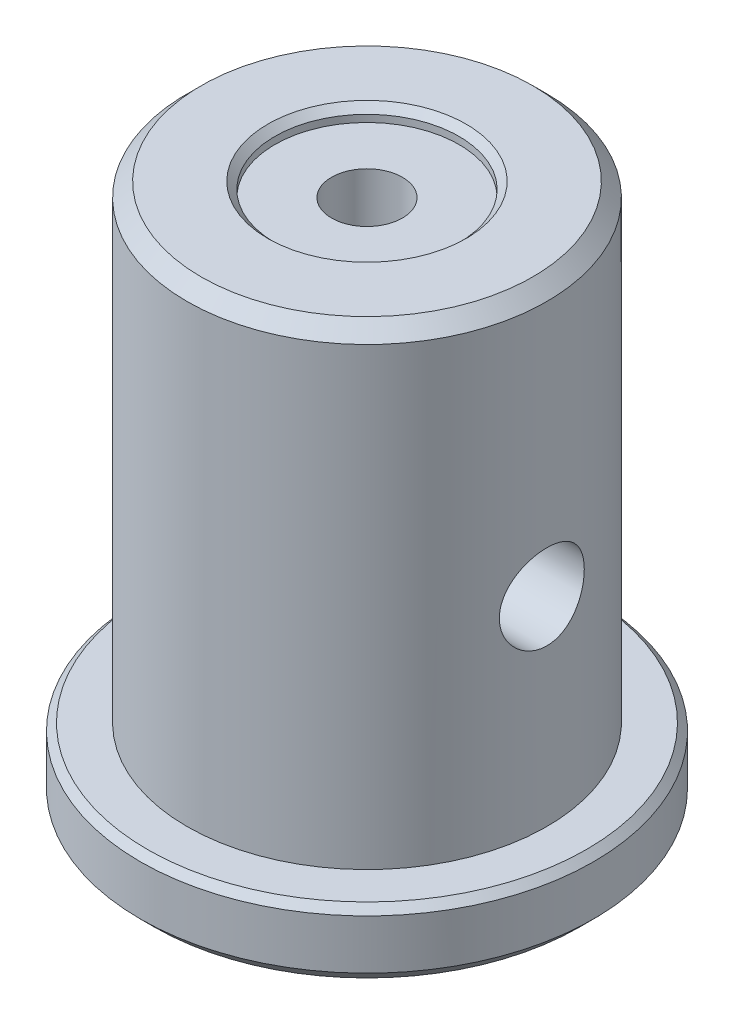
ISO-10303-21;
HEADER;
FILE_DESCRIPTION(('STEP AP214'),'2;1');
FILE_NAME('part.step','',(''),(''),'','','');
FILE_SCHEMA(('AUTOMOTIVE_DESIGN { 1 0 10303 214 1 1 1 1 }'));
ENDSEC;
DATA;
#1=APPLICATION_CONTEXT('core data for automotive mechanical design processes');
#2=APPLICATION_PROTOCOL_DEFINITION('international standard','automotive_design',2000,#1);
#3=PRODUCT_CONTEXT('',#1,'mechanical');
#4=PRODUCT('Part','Part','',(#3));
#5=PRODUCT_RELATED_PRODUCT_CATEGORY('part','',(#4));
#6=PRODUCT_DEFINITION_FORMATION('','',#4);
#7=PRODUCT_DEFINITION_CONTEXT('part definition',#1,'design');
#8=PRODUCT_DEFINITION('design','',#6,#7);
#9=PRODUCT_DEFINITION_SHAPE('','',#8);
#10=(LENGTH_UNIT() NAMED_UNIT(*) SI_UNIT(.MILLI.,.METRE.));
#11=(NAMED_UNIT(*) PLANE_ANGLE_UNIT() SI_UNIT($,.RADIAN.));
#12=(NAMED_UNIT(*) SI_UNIT($,.STERADIAN.) SOLID_ANGLE_UNIT());
#13=UNCERTAINTY_MEASURE_WITH_UNIT(LENGTH_MEASURE(1.E-05),#10,'distance_accuracy_value','');
#14=(GEOMETRIC_REPRESENTATION_CONTEXT(3) GLOBAL_UNCERTAINTY_ASSIGNED_CONTEXT((#13)) GLOBAL_UNIT_ASSIGNED_CONTEXT((#10,
#11,#12)) REPRESENTATION_CONTEXT('',''));
#15=CARTESIAN_POINT('',(0.,0.,0.));
#16=DIRECTION('',(0.,0.,1.));
#17=DIRECTION('',(1.,0.,0.));
#18=AXIS2_PLACEMENT_3D('',#15,#16,#17);
#19=CARTESIAN_POINT('',(0.,-7.09999999986621,0.));
#20=DIRECTION('',(0.,-1.,0.));
#21=DIRECTION('',(1.,0.,0.));
#22=AXIS2_PLACEMENT_3D('',#19,#20,#21);
#23=CONICAL_SURFACE('',#22,2.49999999977035,1.0297442586083);
#24=CARTESIAN_POINT('',(0.,-5.59784845239619,1.13686837721616E-10));
#25=VERTEX_POINT('',#24);
#26=VERTEX_LOOP('',#25);
#27=FACE_BOUND('',#26,.T.);
#28=CARTESIAN_POINT('',(0.,-7.1,0.));
#29=DIRECTION('',(0.,-1.,0.));
#30=DIRECTION('',(0.,0.,-1.));
#31=AXIS2_PLACEMENT_3D('',#28,#29,#30);
#32=CIRCLE('',#31,2.5);
#33=CARTESIAN_POINT('',(0.,-7.1,-2.5));
#34=VERTEX_POINT('',#33);
#35=EDGE_CURVE('E61',#34,#34,#32,.T.);
#36=ORIENTED_EDGE('',*,*,#35,.T.);
#37=EDGE_LOOP('',(#36));
#38=FACE_BOUND('',#37,.T.);
#39=ADVANCED_FACE('F36',(#27,#38),#23,.F.);
#40=CARTESIAN_POINT('',(0.,-18.1,0.));
#41=DIRECTION('',(0.,-1.,0.));
#42=DIRECTION('',(0.,0.,-1.));
#43=AXIS2_PLACEMENT_3D('',#40,#41,#42);
#44=CYLINDRICAL_SURFACE('',#43,2.5);
#45=CARTESIAN_POINT('',(0.,-18.1,0.));
#46=DIRECTION('',(0.,-1.,0.));
#47=DIRECTION('',(0.,0.,-1.));
#48=AXIS2_PLACEMENT_3D('',#45,#46,#47);
#49=CIRCLE('',#48,2.5);
#50=CARTESIAN_POINT('',(0.,-18.1,-2.5));
#51=VERTEX_POINT('',#50);
#52=EDGE_CURVE('E63',#51,#51,#49,.T.);
#53=ORIENTED_EDGE('',*,*,#52,.T.);
#54=EDGE_LOOP('',(#53));
#55=FACE_BOUND('',#54,.T.);
#56=ORIENTED_EDGE('',*,*,#35,.F.);
#57=EDGE_LOOP('',(#56));
#58=FACE_BOUND('',#57,.T.);
#59=ADVANCED_FACE('F57',(#55,#58),#44,.F.);
#60=CARTESIAN_POINT('',(0.,-18.1,0.));
#61=DIRECTION('',(0.,1.,0.));
#62=DIRECTION('',(0.,0.,1.));
#63=AXIS2_PLACEMENT_3D('',#60,#61,#62);
#64=PLANE('',#63);
#65=CARTESIAN_POINT('',(0.,-18.1,0.));
#66=DIRECTION('',(0.,-1.,0.));
#67=DIRECTION('',(0.,0.,-1.));
#68=AXIS2_PLACEMENT_3D('',#65,#66,#67);
#69=CIRCLE('',#68,9.00000000000001);
#70=CARTESIAN_POINT('',(0.,-18.1,-9.00000000000001));
#71=VERTEX_POINT('',#70);
#72=EDGE_CURVE('E66',#71,#71,#69,.T.);
#73=ORIENTED_EDGE('',*,*,#72,.T.);
#74=EDGE_LOOP('',(#73));
#75=FACE_BOUND('',#74,.T.);
#76=ORIENTED_EDGE('',*,*,#52,.F.);
#77=EDGE_LOOP('',(#76));
#78=FACE_BOUND('',#77,.T.);
#79=ADVANCED_FACE('F174',(#75,#78),#64,.F.);
#80=CARTESIAN_POINT('',(0.,6.99999999989132,0.));
#81=DIRECTION('',(0.,1.,0.));
#82=DIRECTION('',(0.,0.,1.));
#83=AXIS2_PLACEMENT_3D('',#80,#81,#82);
#84=CONICAL_SURFACE('',#83,2.49999999977035,1.0297442586083);
#85=CARTESIAN_POINT('',(0.,5.49784845242129,-1.13686837721616E-10));
#86=VERTEX_POINT('',#85);
#87=VERTEX_LOOP('',#86);
#88=FACE_BOUND('',#87,.T.);
#89=CARTESIAN_POINT('',(0.,7.,0.));
#90=DIRECTION('',(0.,1.,0.));
#91=DIRECTION('',(0.,0.,1.));
#92=AXIS2_PLACEMENT_3D('',#89,#90,#91);
#93=CIRCLE('',#92,2.5);
#94=CARTESIAN_POINT('',(0.,7.,2.5));
#95=VERTEX_POINT('',#94);
#96=EDGE_CURVE('E102',#95,#95,#93,.T.);
#97=ORIENTED_EDGE('',*,*,#96,.T.);
#98=EDGE_LOOP('',(#97));
#99=FACE_BOUND('',#98,.T.);
#100=ADVANCED_FACE('F151',(#88,#99),#84,.F.);
#101=CARTESIAN_POINT('',(0.,-18.6,0.));
#102=DIRECTION('',(0.,-1.,0.));
#103=DIRECTION('',(0.,0.,-1.));
#104=AXIS2_PLACEMENT_3D('',#101,#102,#103);
#105=CONICAL_SURFACE('',#104,9.50000000000001,0.785398163397448);
#106=ORIENTED_EDGE('',*,*,#72,.F.);
#107=EDGE_LOOP('',(#106));
#108=FACE_BOUND('',#107,.T.);
#109=CARTESIAN_POINT('',(0.,-18.6,0.));
#110=DIRECTION('',(0.,1.,0.));
#111=DIRECTION('',(0.,0.,1.));
#112=AXIS2_PLACEMENT_3D('',#109,#110,#111);
#113=CIRCLE('',#112,9.50000000000001);
#114=CARTESIAN_POINT('',(0.,-18.6,9.50000000000001));
#115=VERTEX_POINT('',#114);
#116=EDGE_CURVE('E100',#115,#115,#113,.F.);
#117=ORIENTED_EDGE('',*,*,#116,.T.);
#118=EDGE_LOOP('',(#117));
#119=FACE_BOUND('',#118,.T.);
#120=ADVANCED_FACE('F156',(#108,#119),#105,.F.);
#121=CARTESIAN_POINT('',(0.,18.,0.));
#122=DIRECTION('',(0.,1.,0.));
#123=DIRECTION('',(0.,0.,1.));
#124=AXIS2_PLACEMENT_3D('',#121,#122,#123);
#125=CYLINDRICAL_SURFACE('',#124,2.5);
#126=CARTESIAN_POINT('',(0.,18.,0.));
#127=DIRECTION('',(0.,1.,0.));
#128=DIRECTION('',(0.,0.,1.));
#129=AXIS2_PLACEMENT_3D('',#126,#127,#128);
#130=CIRCLE('',#129,2.5);
#131=CARTESIAN_POINT('',(0.,18.,2.5));
#132=VERTEX_POINT('',#131);
#133=EDGE_CURVE('E97',#132,#132,#130,.T.);
#134=ORIENTED_EDGE('',*,*,#133,.T.);
#135=EDGE_LOOP('',(#134));
#136=FACE_BOUND('',#135,.T.);
#137=ORIENTED_EDGE('',*,*,#96,.F.);
#138=EDGE_LOOP('',(#137));
#139=FACE_BOUND('',#138,.T.);
#140=ADVANCED_FACE('F153',(#136,#139),#125,.F.);
#141=CARTESIAN_POINT('',(0.,26.5038387670979,0.));
#142=DIRECTION('',(0.,1.,0.));
#143=DIRECTION('',(0.,0.,1.));
#144=AXIS2_PLACEMENT_3D('',#141,#142,#143);
#145=CYLINDRICAL_SURFACE('',#144,9.50000000000001);
#146=ORIENTED_EDGE('',*,*,#116,.F.);
#147=EDGE_LOOP('',(#146));
#148=FACE_BOUND('',#147,.T.);
#149=CARTESIAN_POINT('',(0.,-19.1,0.));
#150=DIRECTION('',(0.,1.,0.));
#151=DIRECTION('',(0.,0.,1.));
#152=AXIS2_PLACEMENT_3D('',#149,#150,#151);
#153=CIRCLE('',#152,9.50000000000001);
#154=CARTESIAN_POINT('',(0.,-19.1,9.50000000000001));
#155=VERTEX_POINT('',#154);
#156=EDGE_CURVE('E94',#155,#155,#153,.F.);
#157=ORIENTED_EDGE('',*,*,#156,.T.);
#158=EDGE_LOOP('',(#157));
#159=FACE_BOUND('',#158,.T.);
#160=ADVANCED_FACE('F155',(#148,#159),#145,.F.);
#161=CARTESIAN_POINT('',(6.5,18.,0.));
#162=DIRECTION('',(0.,-1.,0.));
#163=DIRECTION('',(0.,0.,-1.));
#164=AXIS2_PLACEMENT_3D('',#161,#162,#163);
#165=PLANE('',#164);
#166=CARTESIAN_POINT('',(0.,18.,0.));
#167=DIRECTION('',(0.,1.,0.));
#168=DIRECTION('',(0.,0.,1.));
#169=AXIS2_PLACEMENT_3D('',#166,#167,#168);
#170=CIRCLE('',#169,6.5);
#171=CARTESIAN_POINT('',(0.,18.,6.5));
#172=VERTEX_POINT('',#171);
#173=EDGE_CURVE('E91',#172,#172,#170,.T.);
#174=ORIENTED_EDGE('',*,*,#173,.T.);
#175=EDGE_LOOP('',(#174));
#176=FACE_BOUND('',#175,.T.);
#177=ORIENTED_EDGE('',*,*,#133,.F.);
#178=EDGE_LOOP('',(#177));
#179=FACE_BOUND('',#178,.T.);
#180=ADVANCED_FACE('F164',(#176,#179),#165,.F.);
#181=CARTESIAN_POINT('',(9.50000000000001,-19.1,0.));
#182=DIRECTION('',(0.,1.,0.));
#183=DIRECTION('',(0.,0.,1.));
#184=AXIS2_PLACEMENT_3D('',#181,#182,#183);
#185=PLANE('',#184);
#186=ORIENTED_EDGE('',*,*,#156,.F.);
#187=EDGE_LOOP('',(#186));
#188=FACE_BOUND('',#187,.T.);
#189=CARTESIAN_POINT('',(0.,-19.1,0.));
#190=DIRECTION('',(0.,1.,0.));
#191=DIRECTION('',(-1.,0.,0.));
#192=AXIS2_PLACEMENT_3D('',#189,#190,#191);
#193=CIRCLE('',#192,15.);
#194=CARTESIAN_POINT('',(-15.,-19.1,0.));
#195=VERTEX_POINT('',#194);
#196=EDGE_CURVE('E87',#195,#195,#193,.T.);
#197=ORIENTED_EDGE('',*,*,#196,.F.);
#198=EDGE_LOOP('',(#197));
#199=FACE_BOUND('',#198,.T.);
#200=ADVANCED_FACE('F241',(#188,#199),#185,.F.);
#201=CARTESIAN_POINT('',(0.,26.5038387670979,0.));
#202=DIRECTION('',(0.,1.,0.));
#203=DIRECTION('',(0.,0.,1.));
#204=AXIS2_PLACEMENT_3D('',#201,#202,#203);
#205=CYLINDRICAL_SURFACE('',#204,6.5);
#206=CARTESIAN_POINT('',(0.,18.5,0.));
#207=DIRECTION('',(0.,1.,0.));
#208=DIRECTION('',(0.,0.,1.));
#209=AXIS2_PLACEMENT_3D('',#206,#207,#208);
#210=CIRCLE('',#209,6.5);
#211=CARTESIAN_POINT('',(0.,18.5,6.5));
#212=VERTEX_POINT('',#211);
#213=EDGE_CURVE('E90',#212,#212,#210,.T.);
#214=ORIENTED_EDGE('',*,*,#213,.T.);
#215=EDGE_LOOP('',(#214));
#216=FACE_BOUND('',#215,.T.);
#217=ORIENTED_EDGE('',*,*,#173,.F.);
#218=EDGE_LOOP('',(#217));
#219=FACE_BOUND('',#218,.T.);
#220=ADVANCED_FACE('F235',(#216,#219),#205,.F.);
#221=CARTESIAN_POINT('',(0.,-18.1,0.));
#222=DIRECTION('',(0.,1.,0.));
#223=DIRECTION('',(-1.,0.,0.));
#224=AXIS2_PLACEMENT_3D('',#221,#222,#223);
#225=CONICAL_SURFACE('',#224,16.,0.785398163397447);
#226=ORIENTED_EDGE('',*,*,#196,.T.);
#227=EDGE_LOOP('',(#226));
#228=FACE_BOUND('',#227,.T.);
#229=CARTESIAN_POINT('',(0.,-18.1,0.));
#230=DIRECTION('',(0.,1.,0.));
#231=DIRECTION('',(0.,0.,1.));
#232=AXIS2_PLACEMENT_3D('',#229,#230,#231);
#233=CIRCLE('',#232,16.);
#234=CARTESIAN_POINT('',(0.,-18.1,16.));
#235=VERTEX_POINT('',#234);
#236=EDGE_CURVE('E86',#235,#235,#233,.T.);
#237=ORIENTED_EDGE('',*,*,#236,.F.);
#238=EDGE_LOOP('',(#237));
#239=FACE_BOUND('',#238,.T.);
#240=ADVANCED_FACE('F231',(#228,#239),#225,.T.);
#241=CARTESIAN_POINT('',(0.,19.,0.));
#242=DIRECTION('',(0.,1.,0.));
#243=DIRECTION('',(0.,0.,1.));
#244=AXIS2_PLACEMENT_3D('',#241,#242,#243);
#245=CONICAL_SURFACE('',#244,7.,0.785398163397448);
#246=CARTESIAN_POINT('',(0.,19.,0.));
#247=DIRECTION('',(0.,1.,0.));
#248=DIRECTION('',(0.,0.,1.));
#249=AXIS2_PLACEMENT_3D('',#246,#247,#248);
#250=CIRCLE('',#249,7.);
#251=CARTESIAN_POINT('',(0.,19.,7.));
#252=VERTEX_POINT('',#251);
#253=EDGE_CURVE('E83',#252,#252,#250,.T.);
#254=ORIENTED_EDGE('',*,*,#253,.T.);
#255=EDGE_LOOP('',(#254));
#256=FACE_BOUND('',#255,.T.);
#257=ORIENTED_EDGE('',*,*,#213,.F.);
#258=EDGE_LOOP('',(#257));
#259=FACE_BOUND('',#258,.T.);
#260=ADVANCED_FACE('F225',(#256,#259),#245,.F.);
#261=CARTESIAN_POINT('',(0.,26.5038387670979,0.));
#262=DIRECTION('',(0.,1.,0.));
#263=DIRECTION('',(0.,0.,1.));
#264=AXIS2_PLACEMENT_3D('',#261,#262,#263);
#265=CYLINDRICAL_SURFACE('',#264,16.);
#266=ORIENTED_EDGE('',*,*,#236,.T.);
#267=EDGE_LOOP('',(#266));
#268=FACE_BOUND('',#267,.T.);
#269=CARTESIAN_POINT('',(0.,-14.6,0.));
#270=DIRECTION('',(0.,-1.,0.));
#271=DIRECTION('',(0.,0.,-1.));
#272=AXIS2_PLACEMENT_3D('',#269,#270,#271);
#273=CIRCLE('',#272,16.);
#274=CARTESIAN_POINT('',(0.,-14.6,-16.));
#275=VERTEX_POINT('',#274);
#276=EDGE_CURVE('E82',#275,#275,#273,.F.);
#277=ORIENTED_EDGE('',*,*,#276,.F.);
#278=EDGE_LOOP('',(#277));
#279=FACE_BOUND('',#278,.T.);
#280=ADVANCED_FACE('F221',(#268,#279),#265,.T.);
#281=CARTESIAN_POINT('',(11.7,19.,0.));
#282=DIRECTION('',(0.,-1.,0.));
#283=DIRECTION('',(0.,0.,-1.));
#284=AXIS2_PLACEMENT_3D('',#281,#282,#283);
#285=PLANE('',#284);
#286=CARTESIAN_POINT('',(0.,19.,0.));
#287=DIRECTION('',(0.,-1.,0.));
#288=DIRECTION('',(0.,0.,-1.));
#289=AXIS2_PLACEMENT_3D('',#286,#287,#288);
#290=CIRCLE('',#289,11.7);
#291=CARTESIAN_POINT('',(0.,19.,-11.7));
#292=VERTEX_POINT('',#291);
#293=EDGE_CURVE('E79',#292,#292,#290,.T.);
#294=ORIENTED_EDGE('',*,*,#293,.F.);
#295=EDGE_LOOP('',(#294));
#296=FACE_BOUND('',#295,.T.);
#297=ORIENTED_EDGE('',*,*,#253,.F.);
#298=EDGE_LOOP('',(#297));
#299=FACE_BOUND('',#298,.T.);
#300=ADVANCED_FACE('F215',(#296,#299),#285,.F.);
#301=CARTESIAN_POINT('',(0.,-14.6,0.));
#302=DIRECTION('',(0.,-1.,0.));
#303=DIRECTION('',(1.,0.,0.));
#304=AXIS2_PLACEMENT_3D('',#301,#302,#303);
#305=CONICAL_SURFACE('',#304,16.,0.78539816339745);
#306=ORIENTED_EDGE('',*,*,#276,.T.);
#307=EDGE_LOOP('',(#306));
#308=FACE_BOUND('',#307,.T.);
#309=CARTESIAN_POINT('',(0.,-14.1,0.));
#310=DIRECTION('',(0.,-1.,0.));
#311=DIRECTION('',(1.,0.,0.));
#312=AXIS2_PLACEMENT_3D('',#309,#310,#311);
#313=CIRCLE('',#312,15.5);
#314=CARTESIAN_POINT('',(15.5,-14.1,0.));
#315=VERTEX_POINT('',#314);
#316=EDGE_CURVE('E76',#315,#315,#313,.T.);
#317=ORIENTED_EDGE('',*,*,#316,.T.);
#318=EDGE_LOOP('',(#317));
#319=FACE_BOUND('',#318,.T.);
#320=ADVANCED_FACE('F211',(#308,#319),#305,.T.);
#321=CARTESIAN_POINT('',(0.,18.,0.));
#322=DIRECTION('',(0.,-1.,0.));
#323=DIRECTION('',(0.,0.,-1.));
#324=AXIS2_PLACEMENT_3D('',#321,#322,#323);
#325=CONICAL_SURFACE('',#324,12.7,0.78539816339745);
#326=CARTESIAN_POINT('',(0.,18.,0.));
#327=DIRECTION('',(0.,1.,0.));
#328=DIRECTION('',(0.,0.,1.));
#329=AXIS2_PLACEMENT_3D('',#326,#327,#328);
#330=CIRCLE('',#329,12.7);
#331=CARTESIAN_POINT('',(0.,18.,12.7));
#332=VERTEX_POINT('',#331);
#333=EDGE_CURVE('E49',#332,#332,#330,.F.);
#334=ORIENTED_EDGE('',*,*,#333,.F.);
#335=EDGE_LOOP('',(#334));
#336=FACE_BOUND('',#335,.T.);
#337=ORIENTED_EDGE('',*,*,#293,.T.);
#338=EDGE_LOOP('',(#337));
#339=FACE_BOUND('',#338,.T.);
#340=ADVANCED_FACE('F207',(#336,#339),#325,.T.);
#341=CARTESIAN_POINT('',(15.5,-14.1,0.));
#342=DIRECTION('',(0.,-1.,0.));
#343=DIRECTION('',(0.,0.,-1.));
#344=AXIS2_PLACEMENT_3D('',#341,#342,#343);
#345=PLANE('',#344);
#346=ORIENTED_EDGE('',*,*,#316,.F.);
#347=EDGE_LOOP('',(#346));
#348=FACE_BOUND('',#347,.T.);
#349=CARTESIAN_POINT('',(0.,-14.1,0.));
#350=DIRECTION('',(0.,1.,0.));
#351=DIRECTION('',(0.,0.,1.));
#352=AXIS2_PLACEMENT_3D('',#349,#350,#351);
#353=CIRCLE('',#352,12.7);
#354=CARTESIAN_POINT('',(0.,-14.1,12.7));
#355=VERTEX_POINT('',#354);
#356=EDGE_CURVE('E11',#355,#355,#353,.T.);
#357=ORIENTED_EDGE('',*,*,#356,.F.);
#358=EDGE_LOOP('',(#357));
#359=FACE_BOUND('',#358,.T.);
#360=ADVANCED_FACE('F117',(#348,#359),#345,.F.);
#361=CARTESIAN_POINT('',(0.,26.5038387670979,0.));
#362=DIRECTION('',(0.,1.,0.));
#363=DIRECTION('',(0.,0.,1.));
#364=AXIS2_PLACEMENT_3D('',#361,#362,#363);
#365=CYLINDRICAL_SURFACE('',#364,12.7);
#366=CARTESIAN_POINT('',(-12.3405834546021,-0.0499999999999997,-3.));
#367=CARTESIAN_POINT('',(-12.3405867552515,-0.215969025775935,-2.9999947986192));
#368=CARTESIAN_POINT('',(-12.3439681639376,-0.381997776506413,-2.98618025270879));
#369=CARTESIAN_POINT('',(-12.3570983771738,-0.709308606239805,-2.93136245477037));
#370=CARTESIAN_POINT('',(-12.3668512939366,-0.870587549383247,-2.89034164338149));
#371=CARTESIAN_POINT('',(-12.3915597141969,-1.1836170544443,-2.78249577795815));
#372=CARTESIAN_POINT('',(-12.406508961645,-1.33537881625545,-2.71570174263797));
#373=CARTESIAN_POINT('',(-12.439917980932,-1.62555316647854,-2.5582975169812));
#374=CARTESIAN_POINT('',(-12.4583778022552,-1.7639655666796,-2.46768699092613));
#375=CARTESIAN_POINT('',(-12.4971341157553,-2.02623513327086,-2.26332000863187));
#376=CARTESIAN_POINT('',(-12.5174573393053,-2.14979121710142,-2.14918216282701));
#377=CARTESIAN_POINT('',(-12.5574177003081,-2.37619548072849,-1.90182286693526));
#378=CARTESIAN_POINT('',(-12.5770547786081,-2.4790418787585,-1.76859977652744));
#379=CARTESIAN_POINT('',(-12.6137239719163,-2.66232062570419,-1.48480893314834));
#380=CARTESIAN_POINT('',(-12.6307208615052,-2.74245999805565,-1.33404702472816));
#381=CARTESIAN_POINT('',(-12.6598909936041,-2.87614924636056,-1.02072515323631));
#382=CARTESIAN_POINT('',(-12.6720648694535,-2.92970261371955,-0.858166742555064));
#383=CARTESIAN_POINT('',(-12.6900283681532,-3.00774319217718,-0.529001629765293));
#384=CARTESIAN_POINT('',(-12.6959299939122,-3.03274094705508,-0.362522187479542));
#385=CARTESIAN_POINT('',(-12.7010733204737,-3.05456039400339,-0.027635028781716));
#386=CARTESIAN_POINT('',(-12.7003159043761,-3.05138582219305,0.140772428985136));
#387=CARTESIAN_POINT('',(-12.6923108785029,-3.01732388504276,0.471204028849369));
#388=CARTESIAN_POINT('',(-12.685192248261,-2.98698723227256,0.6332885302704));
#389=CARTESIAN_POINT('',(-12.6654133212508,-2.90034399521758,0.949998324283786));
#390=CARTESIAN_POINT('',(-12.652752748352,-2.84403611689424,1.10462324477204));
#391=CARTESIAN_POINT('',(-12.6231105369077,-2.70658447194374,1.40351094180074));
#392=CARTESIAN_POINT('',(-12.6060939900068,-2.62523893662922,1.54767732548809));
#393=CARTESIAN_POINT('',(-12.569594968861,-2.44017288338061,1.82050994076874));
#394=CARTESIAN_POINT('',(-12.5501121075764,-2.3364488517769,1.94917373333533));
#395=CARTESIAN_POINT('',(-12.5102557426675,-2.10659648028451,2.19062975846301));
#396=CARTESIAN_POINT('',(-12.4898720962146,-1.97998644564598,2.30296222384418));
#397=CARTESIAN_POINT('',(-12.4509479008397,-1.70951242089481,2.5048957074095));
#398=CARTESIAN_POINT('',(-12.4324074202314,-1.56564779170528,2.59449588325037));
#399=CARTESIAN_POINT('',(-12.3992364452359,-1.26391941122217,2.74867389435204));
#400=CARTESIAN_POINT('',(-12.3846216061614,-1.10600285675176,2.81315199075165));
#401=CARTESIAN_POINT('',(-12.361163891032,-0.781145656487394,2.91450898004239));
#402=CARTESIAN_POINT('',(-12.3523199281954,-0.614206716220897,2.95139306967752));
#403=CARTESIAN_POINT('',(-12.3416305703028,-0.28027884252791,2.99577506689082));
#404=CARTESIAN_POINT('',(-12.3396244346743,-0.11338467084859,3.0039480461921));
#405=CARTESIAN_POINT('',(-12.3424021208832,0.219381976332526,2.99251467034554));
#406=CARTESIAN_POINT('',(-12.3471853912632,0.385254533714076,2.97291057134052));
#407=CARTESIAN_POINT('',(-12.3628499077692,0.70883464396225,2.90706871465485));
#408=CARTESIAN_POINT('',(-12.37364334047,0.866624835840614,2.86121423179317));
#409=CARTESIAN_POINT('',(-12.4000305578142,1.17228105058354,2.74459361459815));
#410=CARTESIAN_POINT('',(-12.4156248628205,1.32014599554064,2.67382477969692));
#411=CARTESIAN_POINT('',(-12.4502018670965,1.60464260798376,2.5079376913544));
#412=CARTESIAN_POINT('',(-12.4692397057665,1.74102882937843,2.41241023649747));
#413=CARTESIAN_POINT('',(-12.508418891342,1.99608323519417,2.20024312204814));
#414=CARTESIAN_POINT('',(-12.5285603989996,2.1147488291373,2.08360038123467));
#415=CARTESIAN_POINT('',(-12.5682154806913,2.33367575658374,1.8294351289871));
#416=CARTESIAN_POINT('',(-12.5877053868826,2.4334731277362,1.69150862917181));
#417=CARTESIAN_POINT('',(-12.6233979717533,2.60848491861007,1.40045958706062));
#418=CARTESIAN_POINT('',(-12.6396008155023,2.68370057289222,1.24733780841667));
#419=CARTESIAN_POINT('',(-12.6667953232136,2.80679899739152,0.931266340092587));
#420=CARTESIAN_POINT('',(-12.6778226529874,2.85486931464834,0.768392904306747));
#421=CARTESIAN_POINT('',(-12.6935789726756,2.92288709761498,0.4365882415509));
#422=CARTESIAN_POINT('',(-12.6983090399519,2.94283937391006,0.267658055874662));
#423=CARTESIAN_POINT('',(-12.7008993537832,2.95380863416807,-0.0670858950952627));
#424=CARTESIAN_POINT('',(-12.698922999739,2.94551382980964,-0.23287620652618));
#425=CARTESIAN_POINT('',(-12.6886792846242,2.90178385470652,-0.56062883555788));
#426=CARTESIAN_POINT('',(-12.6804120752351,2.86634933833887,-0.722591245357751));
#427=CARTESIAN_POINT('',(-12.6585349476798,2.76969776966396,-1.03745535327696));
#428=CARTESIAN_POINT('',(-12.6449483253229,2.70859305324402,-1.19039325739078));
#429=CARTESIAN_POINT('',(-12.6138718519278,2.56244006301943,-1.48392969727621));
#430=CARTESIAN_POINT('',(-12.5963815576374,2.47738906988803,-1.62452682925617));
#431=CARTESIAN_POINT('',(-12.5589188788384,2.2835926487413,-1.89269784116764));
#432=CARTESIAN_POINT('',(-12.538900801949,2.17437232281497,-2.01992216623951));
#433=CARTESIAN_POINT('',(-12.498861896439,1.9362761933158,-2.2544712498921));
#434=CARTESIAN_POINT('',(-12.4788410683609,1.80739553893703,-2.36179108290443));
#435=CARTESIAN_POINT('',(-12.4406982518011,1.53112796939278,-2.55517580989632));
#436=CARTESIAN_POINT('',(-12.4226122154044,1.38347543293646,-2.64086882423842));
#437=CARTESIAN_POINT('',(-12.3908548561017,1.07545954815947,-2.78608721227337));
#438=CARTESIAN_POINT('',(-12.377180079871,0.915106265625365,-2.84563306834565));
#439=CARTESIAN_POINT('',(-12.3581116997091,0.620683067717766,-2.92718665623946));
#440=CARTESIAN_POINT('',(-12.3515853338036,0.488113622566377,-2.95443550510605));
#441=CARTESIAN_POINT('',(-12.3428200100531,0.220375881220646,-2.99084369124859));
#442=CARTESIAN_POINT('',(-12.3405807657064,0.0852077593016652,-3.00000423733911));
#443=CARTESIAN_POINT('',(-12.3405834546021,-0.0499999999999997,-3.));
#444=B_SPLINE_CURVE_WITH_KNOTS('',3,(#366,#367,#368,#369,#370,#371,#372,#373,#374,#375,#376,
#377,#378,#379,#380,#381,#382,#383,#384,#385,#386,#387,#388,#389,#390,#391,#392,#393,#394,#395,
#396,#397,#398,#399,#400,#401,#402,#403,#404,#405,#406,#407,#408,#409,#410,#411,#412,#413,#414,
#415,#416,#417,#418,#419,#420,#421,#422,#423,#424,#425,#426,#427,#428,#429,#430,#431,#432,#433,
#434,#435,#436,#437,#438,#439,#440,#441,#442,#443),.UNSPECIFIED.,.T.,.F.,(4,2,2,2,2,2,2,2,2,2,2,
2,2,2,2,2,2,2,2,2,2,2,2,2,2,2,2,2,2,2,2,2,2,2,2,2,2,2,4),(0.,0.497411026443943,
0.995143402777372,1.49227860492331,1.98942081508859,2.49536478555058,3.00135226653359,
3.51359835731242,4.02577715959639,4.52864792978655,5.03145201194262,5.52428694235286,
6.01714643133854,6.51408654761748,7.01110474580709,7.52015808792639,8.02923029022512,
8.54030348656796,9.05128040890335,9.5501594423104,10.0489979574951,10.5407323472655,
11.0325200545446,11.5330211371553,12.0335953137055,12.5452167410731,13.0568124694697,
13.5648289273917,14.0727584605778,14.568402228839,15.0640340468005,15.5575191492549,
16.0510603142398,16.555330529637,17.0597253658004,17.5722788464447,18.0844300988553,
18.4896763485681,18.8948955153554),.UNSPECIFIED.);
#445=CARTESIAN_POINT('',(-12.3405834546021,-0.0499999999999997,-3.));
#446=VERTEX_POINT('',#445);
#447=EDGE_CURVE('E39',#446,#446,#444,.T.);
#448=ORIENTED_EDGE('',*,*,#447,.F.);
#449=EDGE_LOOP('',(#448));
#450=FACE_BOUND('',#449,.T.);
#451=CARTESIAN_POINT('',(12.3405834546021,-0.0499999999999997,-3.));
#452=CARTESIAN_POINT('',(12.3405867552515,0.115969025775936,-2.9999947986192));
#453=CARTESIAN_POINT('',(12.3439681639376,0.281997776506414,-2.98618025270879));
#454=CARTESIAN_POINT('',(12.3570983771738,0.609308606239806,-2.93136245477037));
#455=CARTESIAN_POINT('',(12.3668512939366,0.770587549383248,-2.89034164338149));
#456=CARTESIAN_POINT('',(12.3915597141969,1.0836170544443,-2.78249577795815));
#457=CARTESIAN_POINT('',(12.406508961645,1.23537881625545,-2.71570174263797));
#458=CARTESIAN_POINT('',(12.439917980932,1.52555316647854,-2.5582975169812));
#459=CARTESIAN_POINT('',(12.4583778022552,1.6639655666796,-2.46768699092613));
#460=CARTESIAN_POINT('',(12.4971341157553,1.92623513327086,-2.26332000863187));
#461=CARTESIAN_POINT('',(12.5174573393053,2.04979121710142,-2.14918216282701));
#462=CARTESIAN_POINT('',(12.5574177003081,2.27619548072849,-1.90182286693526));
#463=CARTESIAN_POINT('',(12.5770547786081,2.37904187875851,-1.76859977652744));
#464=CARTESIAN_POINT('',(12.6137239719163,2.56232062570419,-1.48480893314834));
#465=CARTESIAN_POINT('',(12.6307208615052,2.64245999805565,-1.33404702472816));
#466=CARTESIAN_POINT('',(12.6598909936041,2.77614924636056,-1.02072515323631));
#467=CARTESIAN_POINT('',(12.6720648694535,2.82970261371955,-0.858166742555064));
#468=CARTESIAN_POINT('',(12.6900283681532,2.90774319217718,-0.529001629765293));
#469=CARTESIAN_POINT('',(12.6959299939122,2.93274094705508,-0.362522187479542));
#470=CARTESIAN_POINT('',(12.7010733204737,2.95456039400339,-0.027635028781716));
#471=CARTESIAN_POINT('',(12.7003159043761,2.95138582219306,0.140772428985136));
#472=CARTESIAN_POINT('',(12.6923108785029,2.91732388504276,0.471204028849369));
#473=CARTESIAN_POINT('',(12.685192248261,2.88698723227257,0.6332885302704));
#474=CARTESIAN_POINT('',(12.6654133212508,2.80034399521758,0.949998324283786));
#475=CARTESIAN_POINT('',(12.652752748352,2.74403611689424,1.10462324477204));
#476=CARTESIAN_POINT('',(12.6231105369077,2.60658447194374,1.40351094180074));
#477=CARTESIAN_POINT('',(12.6060939900068,2.52523893662922,1.54767732548809));
#478=CARTESIAN_POINT('',(12.569594968861,2.34017288338061,1.82050994076874));
#479=CARTESIAN_POINT('',(12.5501121075764,2.2364488517769,1.94917373333533));
#480=CARTESIAN_POINT('',(12.5102557426675,2.00659648028451,2.19062975846301));
#481=CARTESIAN_POINT('',(12.4898720962146,1.87998644564598,2.30296222384418));
#482=CARTESIAN_POINT('',(12.4509479008397,1.60951242089481,2.5048957074095));
#483=CARTESIAN_POINT('',(12.4324074202314,1.46564779170528,2.59449588325037));
#484=CARTESIAN_POINT('',(12.3992364452359,1.16391941122218,2.74867389435204));
#485=CARTESIAN_POINT('',(12.3846216061614,1.00600285675176,2.81315199075165));
#486=CARTESIAN_POINT('',(12.361163891032,0.681145656487395,2.91450898004239));
#487=CARTESIAN_POINT('',(12.3523199281954,0.514206716220898,2.95139306967752));
#488=CARTESIAN_POINT('',(12.3416305703028,0.18027884252791,2.99577506689082));
#489=CARTESIAN_POINT('',(12.3396244346743,0.0133846708485905,3.0039480461921));
#490=CARTESIAN_POINT('',(12.3424021208832,-0.319381976332526,2.99251467034554));
#491=CARTESIAN_POINT('',(12.3471853912632,-0.485254533714076,2.97291057134052));
#492=CARTESIAN_POINT('',(12.3628499077692,-0.808834643962249,2.90706871465485));
#493=CARTESIAN_POINT('',(12.37364334047,-0.966624835840613,2.86121423179317));
#494=CARTESIAN_POINT('',(12.4000305578142,-1.27228105058354,2.74459361459815));
#495=CARTESIAN_POINT('',(12.4156248628205,-1.42014599554064,2.67382477969692));
#496=CARTESIAN_POINT('',(12.4502018670965,-1.70464260798376,2.5079376913544));
#497=CARTESIAN_POINT('',(12.4692397057665,-1.84102882937843,2.41241023649747));
#498=CARTESIAN_POINT('',(12.508418891342,-2.09608323519417,2.20024312204814));
#499=CARTESIAN_POINT('',(12.5285603989996,-2.2147488291373,2.08360038123467));
#500=CARTESIAN_POINT('',(12.5682154806913,-2.43367575658373,1.8294351289871));
#501=CARTESIAN_POINT('',(12.5877053868826,-2.53347312773619,1.69150862917181));
#502=CARTESIAN_POINT('',(12.6233979717533,-2.70848491861007,1.40045958706062));
#503=CARTESIAN_POINT('',(12.6396008155023,-2.78370057289222,1.24733780841667));
#504=CARTESIAN_POINT('',(12.6667953232136,-2.90679899739152,0.931266340092587));
#505=CARTESIAN_POINT('',(12.6778226529874,-2.95486931464833,0.768392904306747));
#506=CARTESIAN_POINT('',(12.6935789726756,-3.02288709761498,0.4365882415509));
#507=CARTESIAN_POINT('',(12.6983090399519,-3.04283937391006,0.267658055874662));
#508=CARTESIAN_POINT('',(12.7008993537832,-3.05380863416807,-0.0670858950952627));
#509=CARTESIAN_POINT('',(12.698922999739,-3.04551382980964,-0.23287620652618));
#510=CARTESIAN_POINT('',(12.6886792846242,-3.00178385470652,-0.56062883555788));
#511=CARTESIAN_POINT('',(12.6804120752351,-2.96634933833887,-0.722591245357751));
#512=CARTESIAN_POINT('',(12.6585349476798,-2.86969776966396,-1.03745535327696));
#513=CARTESIAN_POINT('',(12.6449483253229,-2.80859305324402,-1.19039325739078));
#514=CARTESIAN_POINT('',(12.6138718519278,-2.66244006301943,-1.48392969727621));
#515=CARTESIAN_POINT('',(12.5963815576374,-2.57738906988803,-1.62452682925617));
#516=CARTESIAN_POINT('',(12.5589188788384,-2.3835926487413,-1.89269784116764));
#517=CARTESIAN_POINT('',(12.538900801949,-2.27437232281497,-2.01992216623952));
#518=CARTESIAN_POINT('',(12.498861896439,-2.0362761933158,-2.2544712498921));
#519=CARTESIAN_POINT('',(12.4788410683609,-1.90739553893703,-2.36179108290443));
#520=CARTESIAN_POINT('',(12.4406982518011,-1.63112796939278,-2.55517580989632));
#521=CARTESIAN_POINT('',(12.4226122154044,-1.48347543293646,-2.64086882423842));
#522=CARTESIAN_POINT('',(12.3908548561017,-1.17545954815947,-2.78608721227337));
#523=CARTESIAN_POINT('',(12.377180079871,-1.01510626562536,-2.84563306834565));
#524=CARTESIAN_POINT('',(12.3581116997091,-0.720683067717765,-2.92718665623946));
#525=CARTESIAN_POINT('',(12.3515853338036,-0.588113622566376,-2.95443550510605));
#526=CARTESIAN_POINT('',(12.3428200100531,-0.320375881220646,-2.99084369124859));
#527=CARTESIAN_POINT('',(12.3405807657064,-0.185207759301665,-3.00000423733911));
#528=CARTESIAN_POINT('',(12.3405834546021,-0.0499999999999997,-3.));
#529=B_SPLINE_CURVE_WITH_KNOTS('',3,(#451,#452,#453,#454,#455,#456,#457,#458,#459,#460,#461,
#462,#463,#464,#465,#466,#467,#468,#469,#470,#471,#472,#473,#474,#475,#476,#477,#478,#479,#480,
#481,#482,#483,#484,#485,#486,#487,#488,#489,#490,#491,#492,#493,#494,#495,#496,#497,#498,#499,
#500,#501,#502,#503,#504,#505,#506,#507,#508,#509,#510,#511,#512,#513,#514,#515,#516,#517,#518,
#519,#520,#521,#522,#523,#524,#525,#526,#527,#528),.UNSPECIFIED.,.T.,.F.,(4,2,2,2,2,2,2,2,2,2,2,
2,2,2,2,2,2,2,2,2,2,2,2,2,2,2,2,2,2,2,2,2,2,2,2,2,2,2,4),(0.,0.497411026443943,
0.995143402777372,1.49227860492331,1.98942081508859,2.49536478555058,3.00135226653359,
3.51359835731242,4.02577715959639,4.52864792978655,5.03145201194262,5.52428694235286,
6.01714643133854,6.51408654761748,7.01110474580709,7.52015808792639,8.02923029022512,
8.54030348656796,9.05128040890335,9.5501594423104,10.0489979574951,10.5407323472655,
11.0325200545446,11.5330211371553,12.0335953137055,12.5452167410731,13.0568124694697,
13.5648289273917,14.0727584605778,14.568402228839,15.0640340468005,15.5575191492549,
16.0510603142398,16.555330529637,17.0597253658004,17.5722788464447,18.0844300988553,
18.4896763485681,18.8948955153554),.UNSPECIFIED.);
#530=CARTESIAN_POINT('',(12.3405834546021,-0.0499999999999997,-3.));
#531=VERTEX_POINT('',#530);
#532=EDGE_CURVE('E69',#531,#531,#529,.T.);
#533=ORIENTED_EDGE('',*,*,#532,.F.);
#534=EDGE_LOOP('',(#533));
#535=FACE_BOUND('',#534,.T.);
#536=ORIENTED_EDGE('',*,*,#356,.T.);
#537=EDGE_LOOP('',(#536));
#538=FACE_BOUND('',#537,.T.);
#539=ORIENTED_EDGE('',*,*,#333,.T.);
#540=EDGE_LOOP('',(#539));
#541=FACE_BOUND('',#540,.T.);
#542=ADVANCED_FACE('F106',(#450,#535,#538,#541),#365,.T.);
#543=CARTESIAN_POINT('',(-15.,-0.0499999999999997,0.));
#544=DIRECTION('',(1.,0.,0.));
#545=DIRECTION('',(0.,0.,-1.));
#546=AXIS2_PLACEMENT_3D('',#543,#544,#545);
#547=CYLINDRICAL_SURFACE('',#546,3.);
#548=ORIENTED_EDGE('',*,*,#447,.T.);
#549=EDGE_LOOP('',(#548));
#550=FACE_BOUND('',#549,.T.);
#551=ORIENTED_EDGE('',*,*,#532,.T.);
#552=EDGE_LOOP('',(#551));
#553=FACE_BOUND('',#552,.T.);
#554=ADVANCED_FACE('F58',(#550,#553),#547,.F.);
#555=CLOSED_SHELL('',(#39,#59,#79,#100,#120,#140,#160,#180,#200,#220,#240,#260,#280,#300,#320,
#340,#360,#542,#554));
#556=MANIFOLD_SOLID_BREP('B2',#555);
#557=ADVANCED_BREP_SHAPE_REPRESENTATION('',(#18,#556),#14);
#558=SHAPE_DEFINITION_REPRESENTATION(#9,#557);
ENDSEC;
END-ISO-10303-21;
